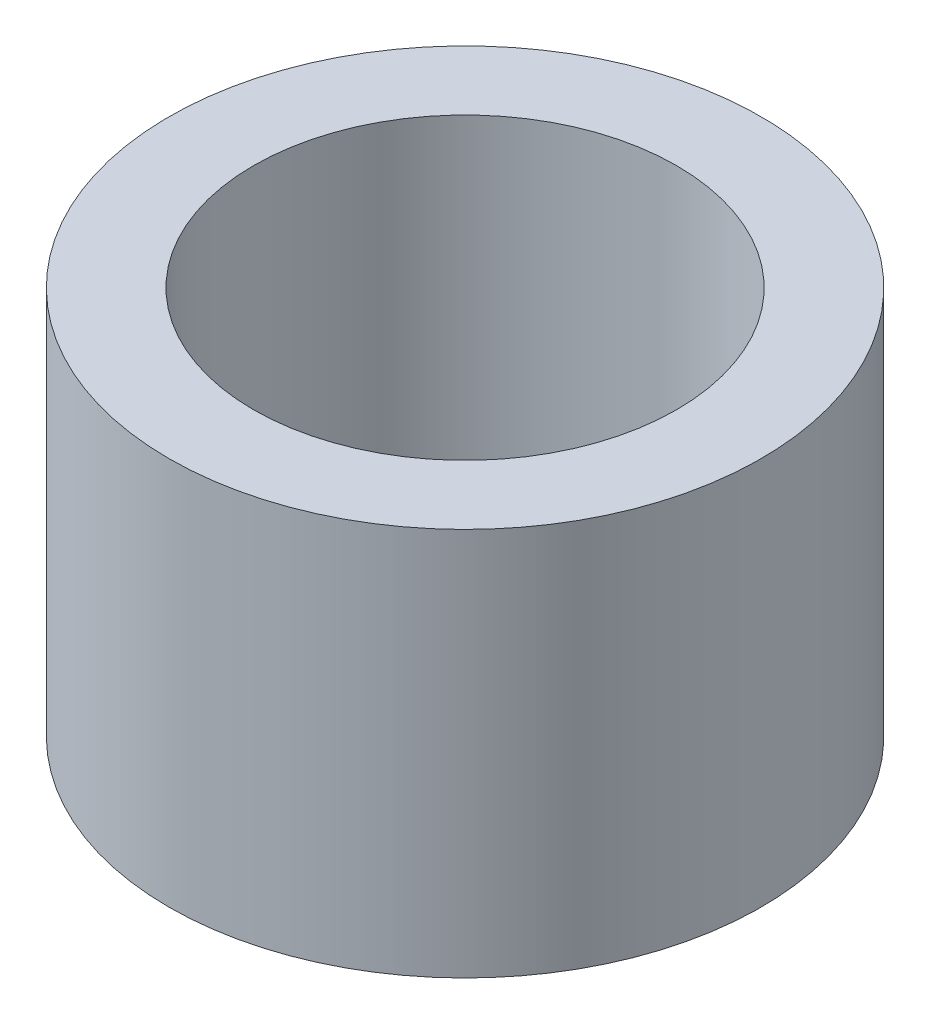
ISO-10303-21;
HEADER;
FILE_DESCRIPTION(('STEP AP214'),'2;1');
FILE_NAME('part.step','',(''),(''),'','','');
FILE_SCHEMA(('AUTOMOTIVE_DESIGN { 1 0 10303 214 1 1 1 1 }'));
ENDSEC;
DATA;
#1=APPLICATION_CONTEXT('core data for automotive mechanical design processes');
#2=APPLICATION_PROTOCOL_DEFINITION('international standard','automotive_design',2000,#1);
#3=PRODUCT_CONTEXT('',#1,'mechanical');
#4=PRODUCT('Part','Part','',(#3));
#5=PRODUCT_RELATED_PRODUCT_CATEGORY('part','',(#4));
#6=PRODUCT_DEFINITION_FORMATION('','',#4);
#7=PRODUCT_DEFINITION_CONTEXT('part definition',#1,'design');
#8=PRODUCT_DEFINITION('design','',#6,#7);
#9=PRODUCT_DEFINITION_SHAPE('','',#8);
#10=(LENGTH_UNIT() NAMED_UNIT(*) SI_UNIT(.MILLI.,.METRE.));
#11=(NAMED_UNIT(*) PLANE_ANGLE_UNIT() SI_UNIT($,.RADIAN.));
#12=(NAMED_UNIT(*) SI_UNIT($,.STERADIAN.) SOLID_ANGLE_UNIT());
#13=UNCERTAINTY_MEASURE_WITH_UNIT(LENGTH_MEASURE(1.E-05),#10,'distance_accuracy_value','');
#14=(GEOMETRIC_REPRESENTATION_CONTEXT(3) GLOBAL_UNCERTAINTY_ASSIGNED_CONTEXT((#13)) GLOBAL_UNIT_ASSIGNED_CONTEXT((#10,
#11,#12)) REPRESENTATION_CONTEXT('',''));
#15=CARTESIAN_POINT('',(0.,0.,0.));
#16=DIRECTION('',(0.,0.,1.));
#17=DIRECTION('',(1.,0.,0.));
#18=AXIS2_PLACEMENT_3D('',#15,#16,#17);
#19=CARTESIAN_POINT('',(0.,14.5796,0.));
#20=DIRECTION('',(0.,1.,0.));
#21=DIRECTION('',(0.,0.,1.));
#22=AXIS2_PLACEMENT_3D('',#19,#20,#21);
#23=PLANE('',#22);
#24=CARTESIAN_POINT('',(0.,14.5796,0.));
#25=DIRECTION('',(0.,1.,0.));
#26=DIRECTION('',(0.,0.,1.));
#27=AXIS2_PLACEMENT_3D('',#24,#25,#26);
#28=CIRCLE('',#27,11.1125);
#29=CARTESIAN_POINT('',(0.,14.5796,11.1125));
#30=VERTEX_POINT('',#29);
#31=EDGE_CURVE('E10',#30,#30,#28,.T.);
#32=ORIENTED_EDGE('',*,*,#31,.T.);
#33=EDGE_LOOP('',(#32));
#34=FACE_BOUND('',#33,.T.);
#35=CARTESIAN_POINT('',(0.,14.5796,0.));
#36=DIRECTION('',(0.,1.,0.));
#37=DIRECTION('',(0.,0.,1.));
#38=AXIS2_PLACEMENT_3D('',#35,#36,#37);
#39=CIRCLE('',#38,7.9375);
#40=CARTESIAN_POINT('',(0.,14.5796,7.9375));
#41=VERTEX_POINT('',#40);
#42=EDGE_CURVE('E41',#41,#41,#39,.T.);
#43=ORIENTED_EDGE('',*,*,#42,.F.);
#44=EDGE_LOOP('',(#43));
#45=FACE_BOUND('',#44,.T.);
#46=ADVANCED_FACE('F30',(#34,#45),#23,.T.);
#47=CARTESIAN_POINT('',(0.,0.,0.));
#48=DIRECTION('',(0.,1.,0.));
#49=DIRECTION('',(0.,0.,1.));
#50=AXIS2_PLACEMENT_3D('',#47,#48,#49);
#51=PLANE('',#50);
#52=CARTESIAN_POINT('',(0.,0.,0.));
#53=DIRECTION('',(0.,1.,0.));
#54=DIRECTION('',(0.,0.,1.));
#55=AXIS2_PLACEMENT_3D('',#52,#53,#54);
#56=CIRCLE('',#55,11.1125);
#57=CARTESIAN_POINT('',(0.,0.,11.1125));
#58=VERTEX_POINT('',#57);
#59=EDGE_CURVE('E34',#58,#58,#56,.T.);
#60=ORIENTED_EDGE('',*,*,#59,.F.);
#61=EDGE_LOOP('',(#60));
#62=FACE_BOUND('',#61,.T.);
#63=CARTESIAN_POINT('',(0.,0.,0.));
#64=DIRECTION('',(0.,1.,0.));
#65=DIRECTION('',(0.,0.,1.));
#66=AXIS2_PLACEMENT_3D('',#63,#64,#65);
#67=CIRCLE('',#66,7.9375);
#68=CARTESIAN_POINT('',(0.,0.,7.9375));
#69=VERTEX_POINT('',#68);
#70=EDGE_CURVE('E43',#69,#69,#67,.T.);
#71=ORIENTED_EDGE('',*,*,#70,.T.);
#72=EDGE_LOOP('',(#71));
#73=FACE_BOUND('',#72,.T.);
#74=ADVANCED_FACE('F53',(#62,#73),#51,.F.);
#75=CARTESIAN_POINT('',(0.,14.5796,0.));
#76=DIRECTION('',(0.,-1.,0.));
#77=DIRECTION('',(0.,0.,-1.));
#78=AXIS2_PLACEMENT_3D('',#75,#76,#77);
#79=CYLINDRICAL_SURFACE('',#78,11.1125);
#80=ORIENTED_EDGE('',*,*,#31,.F.);
#81=EDGE_LOOP('',(#80));
#82=FACE_BOUND('',#81,.T.);
#83=ORIENTED_EDGE('',*,*,#59,.T.);
#84=EDGE_LOOP('',(#83));
#85=FACE_BOUND('',#84,.T.);
#86=ADVANCED_FACE('F32',(#82,#85),#79,.T.);
#87=CARTESIAN_POINT('',(0.,14.5796,0.));
#88=DIRECTION('',(0.,-1.,0.));
#89=DIRECTION('',(0.,0.,-1.));
#90=AXIS2_PLACEMENT_3D('',#87,#88,#89);
#91=CYLINDRICAL_SURFACE('',#90,7.9375);
#92=ORIENTED_EDGE('',*,*,#42,.T.);
#93=EDGE_LOOP('',(#92));
#94=FACE_BOUND('',#93,.T.);
#95=ORIENTED_EDGE('',*,*,#70,.F.);
#96=EDGE_LOOP('',(#95));
#97=FACE_BOUND('',#96,.T.);
#98=ADVANCED_FACE('F49',(#94,#97),#91,.F.);
#99=CLOSED_SHELL('',(#46,#74,#86,#98));
#100=MANIFOLD_SOLID_BREP('B2',#99);
#101=ADVANCED_BREP_SHAPE_REPRESENTATION('',(#18,#100),#14);
#102=SHAPE_DEFINITION_REPRESENTATION(#9,#101);
ENDSEC;
END-ISO-10303-21;
